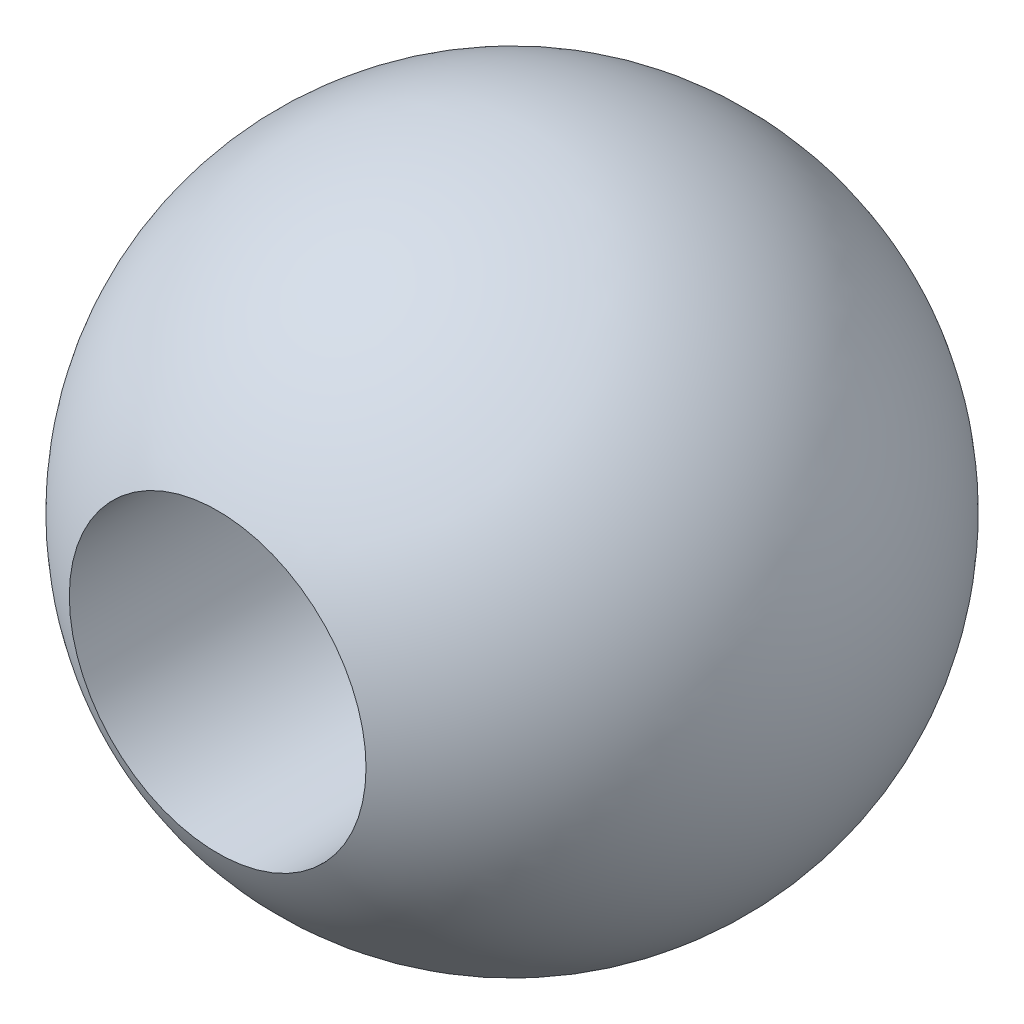
ISO-10303-21;
HEADER;
FILE_DESCRIPTION(('STEP AP214'),'2;1');
FILE_NAME('part.step','',(''),(''),'','','');
FILE_SCHEMA(('AUTOMOTIVE_DESIGN { 1 0 10303 214 1 1 1 1 }'));
ENDSEC;
DATA;
#1=APPLICATION_CONTEXT('core data for automotive mechanical design processes');
#2=APPLICATION_PROTOCOL_DEFINITION('international standard','automotive_design',2000,#1);
#3=PRODUCT_CONTEXT('',#1,'mechanical');
#4=PRODUCT('Part','Part','',(#3));
#5=PRODUCT_RELATED_PRODUCT_CATEGORY('part','',(#4));
#6=PRODUCT_DEFINITION_FORMATION('','',#4);
#7=PRODUCT_DEFINITION_CONTEXT('part definition',#1,'design');
#8=PRODUCT_DEFINITION('design','',#6,#7);
#9=PRODUCT_DEFINITION_SHAPE('','',#8);
#10=(LENGTH_UNIT() NAMED_UNIT(*) SI_UNIT(.MILLI.,.METRE.));
#11=(NAMED_UNIT(*) PLANE_ANGLE_UNIT() SI_UNIT($,.RADIAN.));
#12=(NAMED_UNIT(*) SI_UNIT($,.STERADIAN.) SOLID_ANGLE_UNIT());
#13=UNCERTAINTY_MEASURE_WITH_UNIT(LENGTH_MEASURE(1.E-05),#10,'distance_accuracy_value','');
#14=(GEOMETRIC_REPRESENTATION_CONTEXT(3) GLOBAL_UNCERTAINTY_ASSIGNED_CONTEXT((#13)) GLOBAL_UNIT_ASSIGNED_CONTEXT((#10,
#11,#12)) REPRESENTATION_CONTEXT('',''));
#15=CARTESIAN_POINT('',(0.,0.,0.));
#16=DIRECTION('',(0.,0.,1.));
#17=DIRECTION('',(1.,0.,0.));
#18=AXIS2_PLACEMENT_3D('',#15,#16,#17);
#19=CARTESIAN_POINT('',(0.,0.,0.));
#20=DIRECTION('',(0.,-1.,0.));
#21=DIRECTION('',(-1.,0.,0.));
#22=AXIS2_PLACEMENT_3D('',#19,#20,#21);
#23=SPHERICAL_SURFACE('',#22,5.555);
#24=CARTESIAN_POINT('',(0.,0.,0.));
#25=DIRECTION('',(0.,0.,-1.));
#26=DIRECTION('',(-1.,0.,0.));
#27=AXIS2_PLACEMENT_3D('',#24,#25,#26);
#28=SPHERICAL_SURFACE('',#27,5.555);
#29=CARTESIAN_POINT('',(0.,0.,4.96064763916971));
#30=DIRECTION('',(0.,0.,-1.));
#31=DIRECTION('',(-1.,0.,0.));
#32=AXIS2_PLACEMENT_3D('',#29,#30,#31);
#33=CIRCLE('',#32,2.5);
#34=CARTESIAN_POINT('',(-2.5,0.,4.96064763916971));
#35=VERTEX_POINT('',#34);
#36=EDGE_CURVE('E10',#35,#35,#33,.T.);
#37=ORIENTED_EDGE('',*,*,#36,.T.);
#38=EDGE_LOOP('',(#37));
#39=FACE_BOUND('',#38,.T.);
#40=CARTESIAN_POINT('',(0.,0.,-4.96064763916971));
#41=DIRECTION('',(0.,0.,1.));
#42=DIRECTION('',(1.,0.,0.));
#43=AXIS2_PLACEMENT_3D('',#40,#41,#42);
#44=CIRCLE('',#43,2.5);
#45=CARTESIAN_POINT('',(2.5,0.,-4.96064763916971));
#46=VERTEX_POINT('',#45);
#47=EDGE_CURVE('E45',#46,#46,#44,.T.);
#48=ORIENTED_EDGE('',*,*,#47,.T.);
#49=EDGE_LOOP('',(#48));
#50=FACE_BOUND('',#49,.T.);
#51=ADVANCED_FACE('F39',(#39,#50),#28,.T.);
#52=CARTESIAN_POINT('',(0.,0.,-5.555));
#53=DIRECTION('',(0.,0.,1.));
#54=DIRECTION('',(1.,0.,0.));
#55=AXIS2_PLACEMENT_3D('',#52,#53,#54);
#56=CYLINDRICAL_SURFACE('',#55,2.5);
#57=ORIENTED_EDGE('',*,*,#47,.F.);
#58=EDGE_LOOP('',(#57));
#59=FACE_BOUND('',#58,.T.);
#60=ORIENTED_EDGE('',*,*,#36,.F.);
#61=EDGE_LOOP('',(#60));
#62=FACE_BOUND('',#61,.T.);
#63=ADVANCED_FACE('F52',(#59,#62),#56,.F.);
#64=CLOSED_SHELL('',(#51,#63));
#65=MANIFOLD_SOLID_BREP('B2',#64);
#66=ADVANCED_BREP_SHAPE_REPRESENTATION('',(#18,#65),#14);
#67=SHAPE_DEFINITION_REPRESENTATION(#9,#66);
ENDSEC;
END-ISO-10303-21;
